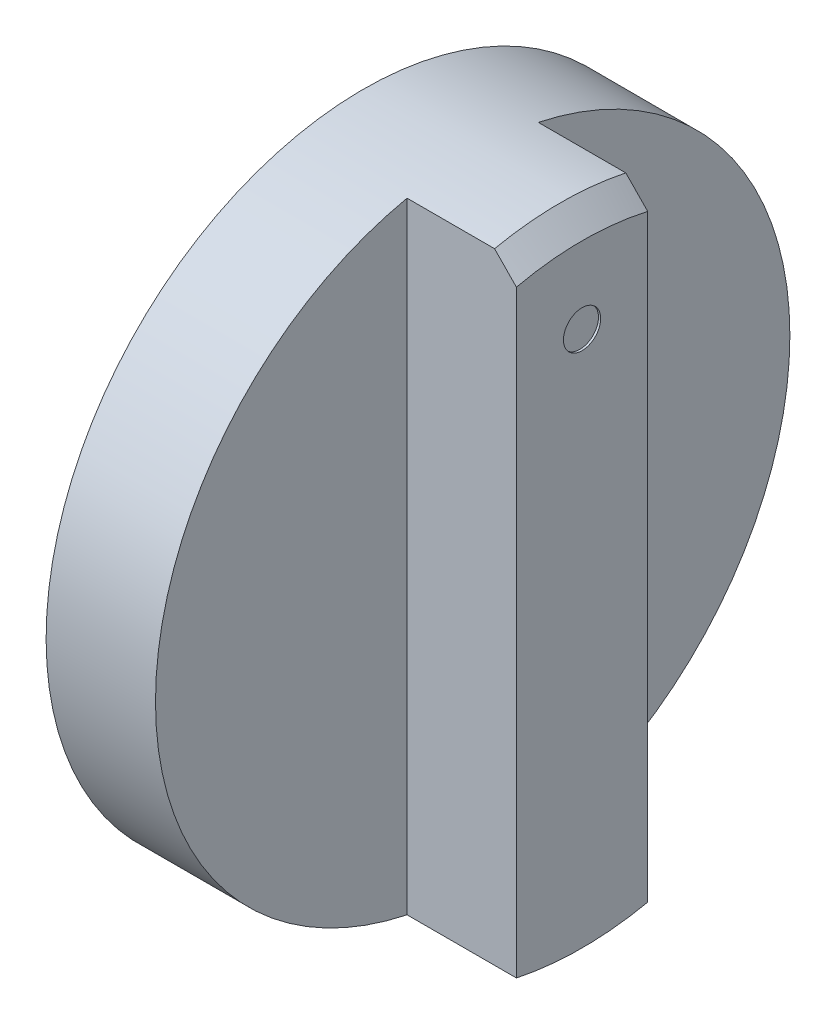
ISO-10303-21;
HEADER;
FILE_DESCRIPTION(('STEP AP214'),'2;1');
FILE_NAME('part.step','',(''),(''),'','','');
FILE_SCHEMA(('AUTOMOTIVE_DESIGN { 1 0 10303 214 1 1 1 1 }'));
ENDSEC;
DATA;
#1=APPLICATION_CONTEXT('core data for automotive mechanical design processes');
#2=APPLICATION_PROTOCOL_DEFINITION('international standard','automotive_design',2000,#1);
#3=PRODUCT_CONTEXT('',#1,'mechanical');
#4=PRODUCT('Part','Part','',(#3));
#5=PRODUCT_RELATED_PRODUCT_CATEGORY('part','',(#4));
#6=PRODUCT_DEFINITION_FORMATION('','',#4);
#7=PRODUCT_DEFINITION_CONTEXT('part definition',#1,'design');
#8=PRODUCT_DEFINITION('design','',#6,#7);
#9=PRODUCT_DEFINITION_SHAPE('','',#8);
#10=(LENGTH_UNIT() NAMED_UNIT(*) SI_UNIT(.MILLI.,.METRE.));
#11=(NAMED_UNIT(*) PLANE_ANGLE_UNIT() SI_UNIT($,.RADIAN.));
#12=(NAMED_UNIT(*) SI_UNIT($,.STERADIAN.) SOLID_ANGLE_UNIT());
#13=UNCERTAINTY_MEASURE_WITH_UNIT(LENGTH_MEASURE(1.E-05),#10,'distance_accuracy_value','');
#14=(GEOMETRIC_REPRESENTATION_CONTEXT(3) GLOBAL_UNCERTAINTY_ASSIGNED_CONTEXT((#13)) GLOBAL_UNIT_ASSIGNED_CONTEXT((#10,
#11,#12)) REPRESENTATION_CONTEXT('',''));
#15=CARTESIAN_POINT('',(0.,0.,0.));
#16=DIRECTION('',(0.,0.,1.));
#17=DIRECTION('',(1.,0.,0.));
#18=AXIS2_PLACEMENT_3D('',#15,#16,#17);
#19=CARTESIAN_POINT('',(5.,0.,0.));
#20=DIRECTION('',(1.,0.,0.));
#21=DIRECTION('',(0.,0.,-1.));
#22=AXIS2_PLACEMENT_3D('',#19,#20,#21);
#23=PLANE('',#22);
#24=CARTESIAN_POINT('',(5.,0.,0.));
#25=DIRECTION('',(1.,0.,0.));
#26=DIRECTION('',(0.,0.,-1.));
#27=AXIS2_PLACEMENT_3D('',#24,#25,#26);
#28=CIRCLE('',#27,14.5);
#29=CARTESIAN_POINT('',(5.,-14.1862609591111,-3.));
#30=VERTEX_POINT('',#29);
#31=CARTESIAN_POINT('',(5.,14.1862609591111,-3.));
#32=VERTEX_POINT('',#31);
#33=EDGE_CURVE('E145',#30,#32,#28,.T.);
#34=ORIENTED_EDGE('',*,*,#33,.T.);
#35=DIRECTION('',(0.,-1.,0.));
#36=VECTOR('',#35,1.);
#37=CARTESIAN_POINT('',(5.,0.,-3.));
#38=LINE('',#37,#36);
#39=EDGE_CURVE('E122',#32,#30,#38,.T.);
#40=ORIENTED_EDGE('',*,*,#39,.T.);
#41=EDGE_LOOP('',(#34,#40));
#42=FACE_BOUND('',#41,.T.);
#43=ADVANCED_FACE('F36',(#42),#23,.T.);
#44=CARTESIAN_POINT('',(5.,0.,0.));
#45=DIRECTION('',(-1.,0.,0.));
#46=DIRECTION('',(0.,0.,1.));
#47=AXIS2_PLACEMENT_3D('',#44,#45,#46);
#48=CYLINDRICAL_SURFACE('',#47,14.5);
#49=DIRECTION('',(-1.,0.,0.));
#50=VECTOR('',#49,1.);
#51=CARTESIAN_POINT('',(10.,14.1862609591111,3.));
#52=LINE('',#51,#50);
#53=CARTESIAN_POINT('',(9.,14.1862609591111,3.));
#54=VERTEX_POINT('',#53);
#55=CARTESIAN_POINT('',(5.,14.1862609591111,3.));
#56=VERTEX_POINT('',#55);
#57=EDGE_CURVE('E105',#54,#56,#52,.T.);
#58=ORIENTED_EDGE('',*,*,#57,.F.);
#59=CARTESIAN_POINT('',(9.,0.,0.));
#60=DIRECTION('',(1.,0.,0.));
#61=DIRECTION('',(0.,0.,-1.));
#62=AXIS2_PLACEMENT_3D('',#59,#60,#61);
#63=CIRCLE('',#62,14.5);
#64=CARTESIAN_POINT('',(9.,14.1862609591111,-3.));
#65=VERTEX_POINT('',#64);
#66=EDGE_CURVE('E50',#54,#65,#63,.F.);
#67=ORIENTED_EDGE('',*,*,#66,.T.);
#68=DIRECTION('',(-1.,0.,0.));
#69=VECTOR('',#68,1.);
#70=CARTESIAN_POINT('',(10.,14.1862609591111,-3.));
#71=LINE('',#70,#69);
#72=EDGE_CURVE('E133',#65,#32,#71,.T.);
#73=ORIENTED_EDGE('',*,*,#72,.T.);
#74=ORIENTED_EDGE('',*,*,#33,.F.);
#75=DIRECTION('',(-1.,0.,0.));
#76=VECTOR('',#75,1.);
#77=CARTESIAN_POINT('',(10.,-14.1862609591111,-3.));
#78=LINE('',#77,#76);
#79=CARTESIAN_POINT('',(10.,-14.1862609591111,-3.));
#80=VERTEX_POINT('',#79);
#81=EDGE_CURVE('E106',#80,#30,#78,.T.);
#82=ORIENTED_EDGE('',*,*,#81,.F.);
#83=CARTESIAN_POINT('',(10.,0.,0.));
#84=DIRECTION('',(1.,0.,0.));
#85=DIRECTION('',(0.,0.,-1.));
#86=AXIS2_PLACEMENT_3D('',#83,#84,#85);
#87=CIRCLE('',#86,14.5);
#88=CARTESIAN_POINT('',(10.,-14.1862609591111,3.));
#89=VERTEX_POINT('',#88);
#90=EDGE_CURVE('E92',#89,#80,#87,.T.);
#91=ORIENTED_EDGE('',*,*,#90,.F.);
#92=DIRECTION('',(-1.,0.,0.));
#93=VECTOR('',#92,1.);
#94=CARTESIAN_POINT('',(10.,-14.1862609591111,3.));
#95=LINE('',#94,#93);
#96=CARTESIAN_POINT('',(5.,-14.1862609591111,3.));
#97=VERTEX_POINT('',#96);
#98=EDGE_CURVE('E100',#89,#97,#95,.T.);
#99=ORIENTED_EDGE('',*,*,#98,.T.);
#100=EDGE_CURVE('E131',#56,#97,#28,.T.);
#101=ORIENTED_EDGE('',*,*,#100,.F.);
#102=EDGE_LOOP('',(#58,#67,#73,#74,#82,#91,#99,#101));
#103=FACE_BOUND('',#102,.T.);
#104=CARTESIAN_POINT('',(0.,0.,0.));
#105=DIRECTION('',(1.,0.,0.));
#106=DIRECTION('',(0.,0.,-1.));
#107=AXIS2_PLACEMENT_3D('',#104,#105,#106);
#108=CIRCLE('',#107,14.5);
#109=CARTESIAN_POINT('',(0.,0.,-14.5));
#110=VERTEX_POINT('',#109);
#111=EDGE_CURVE('E149',#110,#110,#108,.T.);
#112=ORIENTED_EDGE('',*,*,#111,.T.);
#113=EDGE_LOOP('',(#112));
#114=FACE_BOUND('',#113,.T.);
#115=ADVANCED_FACE('F108',(#103,#114),#48,.T.);
#116=DIRECTION('',(0.,-1.,0.));
#117=VECTOR('',#116,1.);
#118=CARTESIAN_POINT('',(5.,0.,3.));
#119=LINE('',#118,#117);
#120=EDGE_CURVE('E103',#56,#97,#119,.T.);
#121=ORIENTED_EDGE('',*,*,#120,.F.);
#122=ORIENTED_EDGE('',*,*,#100,.T.);
#123=EDGE_LOOP('',(#121,#122));
#124=FACE_BOUND('',#123,.T.);
#125=ADVANCED_FACE('F173',(#124),#23,.T.);
#126=CARTESIAN_POINT('',(0.,0.,0.));
#127=DIRECTION('',(1.,0.,0.));
#128=DIRECTION('',(0.,0.,-1.));
#129=AXIS2_PLACEMENT_3D('',#126,#127,#128);
#130=PLANE('',#129);
#131=ORIENTED_EDGE('',*,*,#111,.F.);
#132=EDGE_LOOP('',(#131));
#133=FACE_BOUND('',#132,.T.);
#134=ADVANCED_FACE('F179',(#133),#130,.F.);
#135=CARTESIAN_POINT('',(10.,0.,-3.));
#136=DIRECTION('',(0.,0.,-1.));
#137=DIRECTION('',(-1.,0.,0.));
#138=AXIS2_PLACEMENT_3D('',#135,#136,#137);
#139=PLANE('',#138);
#140=ORIENTED_EDGE('',*,*,#72,.F.);
#141=CARTESIAN_POINT('',(9.,14.1862609591111,-3.));
#142=CARTESIAN_POINT('',(9.16681348101235,14.0157686310232,-3.));
#143=CARTESIAN_POINT('',(9.33355355430151,13.8452046027085,-3.));
#144=CARTESIAN_POINT('',(9.66688688763679,13.5039331433694,-3.));
#145=CARTESIAN_POINT('',(9.83348014768096,13.3332257123432,-3.));
#146=CARTESIAN_POINT('',(10.,13.1624465810882,-3.));
#147=B_SPLINE_CURVE_WITH_KNOTS('',3,(#141,#142,#143,#144,#145,#146),.UNSPECIFIED.,.F.,.F.,(4,2,
4),(0.,0.715576032409501,1.43115207427886),.UNSPECIFIED.);
#148=CARTESIAN_POINT('',(10.,13.1624465810882,-3.));
#149=VERTEX_POINT('',#148);
#150=EDGE_CURVE('E11',#65,#149,#147,.T.);
#151=ORIENTED_EDGE('',*,*,#150,.T.);
#152=DIRECTION('',(0.,-1.,0.));
#153=VECTOR('',#152,1.);
#154=CARTESIAN_POINT('',(10.,0.,-3.));
#155=LINE('',#154,#153);
#156=EDGE_CURVE('E96',#149,#80,#155,.T.);
#157=ORIENTED_EDGE('',*,*,#156,.T.);
#158=ORIENTED_EDGE('',*,*,#81,.T.);
#159=ORIENTED_EDGE('',*,*,#39,.F.);
#160=EDGE_LOOP('',(#140,#151,#157,#158,#159));
#161=FACE_BOUND('',#160,.T.);
#162=ADVANCED_FACE('F158',(#161),#139,.T.);
#163=CARTESIAN_POINT('',(10.,0.,3.));
#164=DIRECTION('',(0.,0.,-1.));
#165=DIRECTION('',(-1.,0.,0.));
#166=AXIS2_PLACEMENT_3D('',#163,#164,#165);
#167=PLANE('',#166);
#168=DIRECTION('',(0.,-1.,0.));
#169=VECTOR('',#168,1.);
#170=CARTESIAN_POINT('',(10.,0.,3.));
#171=LINE('',#170,#169);
#172=CARTESIAN_POINT('',(10.,13.1624465810882,3.));
#173=VERTEX_POINT('',#172);
#174=EDGE_CURVE('E87',#173,#89,#171,.T.);
#175=ORIENTED_EDGE('',*,*,#174,.F.);
#176=CARTESIAN_POINT('',(10.,13.1624465810882,3.));
#177=CARTESIAN_POINT('',(9.83348014768096,13.3332257123432,3.));
#178=CARTESIAN_POINT('',(9.66688688763679,13.5039331433694,3.));
#179=CARTESIAN_POINT('',(9.33355355430151,13.8452046027085,3.));
#180=CARTESIAN_POINT('',(9.16681348101235,14.0157686310232,3.));
#181=CARTESIAN_POINT('',(9.,14.1862609591111,3.));
#182=B_SPLINE_CURVE_WITH_KNOTS('',3,(#176,#177,#178,#179,#180,#181),.UNSPECIFIED.,.F.,.F.,(4,2,
4),(0.,0.715576041869359,1.43115207427886),.UNSPECIFIED.);
#183=EDGE_CURVE('E64',#173,#54,#182,.T.);
#184=ORIENTED_EDGE('',*,*,#183,.T.);
#185=ORIENTED_EDGE('',*,*,#57,.T.);
#186=ORIENTED_EDGE('',*,*,#120,.T.);
#187=ORIENTED_EDGE('',*,*,#98,.F.);
#188=EDGE_LOOP('',(#175,#184,#185,#186,#187));
#189=FACE_BOUND('',#188,.T.);
#190=ADVANCED_FACE('F101',(#189),#167,.F.);
#191=CARTESIAN_POINT('',(10.,0.,0.));
#192=DIRECTION('',(1.,0.,0.));
#193=DIRECTION('',(0.,0.,-1.));
#194=AXIS2_PLACEMENT_3D('',#191,#192,#193);
#195=PLANE('',#194);
#196=CARTESIAN_POINT('',(10.,10.,0.));
#197=DIRECTION('',(1.,0.,0.));
#198=DIRECTION('',(0.,0.,-1.));
#199=AXIS2_PLACEMENT_3D('',#196,#197,#198);
#200=CIRCLE('',#199,0.85);
#201=CARTESIAN_POINT('',(10.,10.,-0.85));
#202=VERTEX_POINT('',#201);
#203=EDGE_CURVE('E200',#202,#202,#200,.T.);
#204=ORIENTED_EDGE('',*,*,#203,.F.);
#205=EDGE_LOOP('',(#204));
#206=FACE_BOUND('',#205,.T.);
#207=ORIENTED_EDGE('',*,*,#156,.F.);
#208=CARTESIAN_POINT('',(10.,0.,0.));
#209=DIRECTION('',(1.,0.,0.));
#210=DIRECTION('',(0.,0.,-1.));
#211=AXIS2_PLACEMENT_3D('',#208,#209,#210);
#212=CIRCLE('',#211,13.5);
#213=EDGE_CURVE('E95',#149,#173,#212,.T.);
#214=ORIENTED_EDGE('',*,*,#213,.T.);
#215=ORIENTED_EDGE('',*,*,#174,.T.);
#216=ORIENTED_EDGE('',*,*,#90,.T.);
#217=EDGE_LOOP('',(#207,#214,#215,#216));
#218=FACE_BOUND('',#217,.T.);
#219=ADVANCED_FACE('F90',(#206,#218),#195,.T.);
#220=CARTESIAN_POINT('',(10.,0.,0.));
#221=DIRECTION('',(-1.,0.,0.));
#222=DIRECTION('',(0.,0.,1.));
#223=AXIS2_PLACEMENT_3D('',#220,#221,#222);
#224=CONICAL_SURFACE('',#223,13.5,0.785398163397448);
#225=ORIENTED_EDGE('',*,*,#150,.F.);
#226=ORIENTED_EDGE('',*,*,#66,.F.);
#227=ORIENTED_EDGE('',*,*,#183,.F.);
#228=ORIENTED_EDGE('',*,*,#213,.F.);
#229=EDGE_LOOP('',(#225,#226,#227,#228));
#230=FACE_BOUND('',#229,.T.);
#231=ADVANCED_FACE('F38',(#230),#224,.T.);
#232=CARTESIAN_POINT('',(9.9,10.,0.));
#233=DIRECTION('',(1.,0.,0.));
#234=DIRECTION('',(0.,0.,-1.));
#235=AXIS2_PLACEMENT_3D('',#232,#233,#234);
#236=CYLINDRICAL_SURFACE('',#235,0.85);
#237=CARTESIAN_POINT('',(9.9,10.,0.));
#238=DIRECTION('',(1.,0.,0.));
#239=DIRECTION('',(0.,0.,-1.));
#240=AXIS2_PLACEMENT_3D('',#237,#238,#239);
#241=CIRCLE('',#240,0.85);
#242=CARTESIAN_POINT('',(9.9,10.,-0.85));
#243=VERTEX_POINT('',#242);
#244=EDGE_CURVE('E124',#243,#243,#241,.T.);
#245=ORIENTED_EDGE('',*,*,#244,.F.);
#246=EDGE_LOOP('',(#245));
#247=FACE_BOUND('',#246,.T.);
#248=ORIENTED_EDGE('',*,*,#203,.T.);
#249=EDGE_LOOP('',(#248));
#250=FACE_BOUND('',#249,.T.);
#251=ADVANCED_FACE('F161',(#247,#250),#236,.F.);
#252=CARTESIAN_POINT('',(9.9,10.,0.));
#253=DIRECTION('',(1.,0.,0.));
#254=DIRECTION('',(0.,0.,-1.));
#255=AXIS2_PLACEMENT_3D('',#252,#253,#254);
#256=PLANE('',#255);
#257=ORIENTED_EDGE('',*,*,#244,.T.);
#258=EDGE_LOOP('',(#257));
#259=FACE_BOUND('',#258,.T.);
#260=ADVANCED_FACE('F166',(#259),#256,.T.);
#261=CLOSED_SHELL('',(#43,#115,#125,#134,#162,#190,#219,#231,#251,#260));
#262=MANIFOLD_SOLID_BREP('B2',#261);
#263=ADVANCED_BREP_SHAPE_REPRESENTATION('',(#18,#262),#14);
#264=SHAPE_DEFINITION_REPRESENTATION(#9,#263);
ENDSEC;
END-ISO-10303-21;
